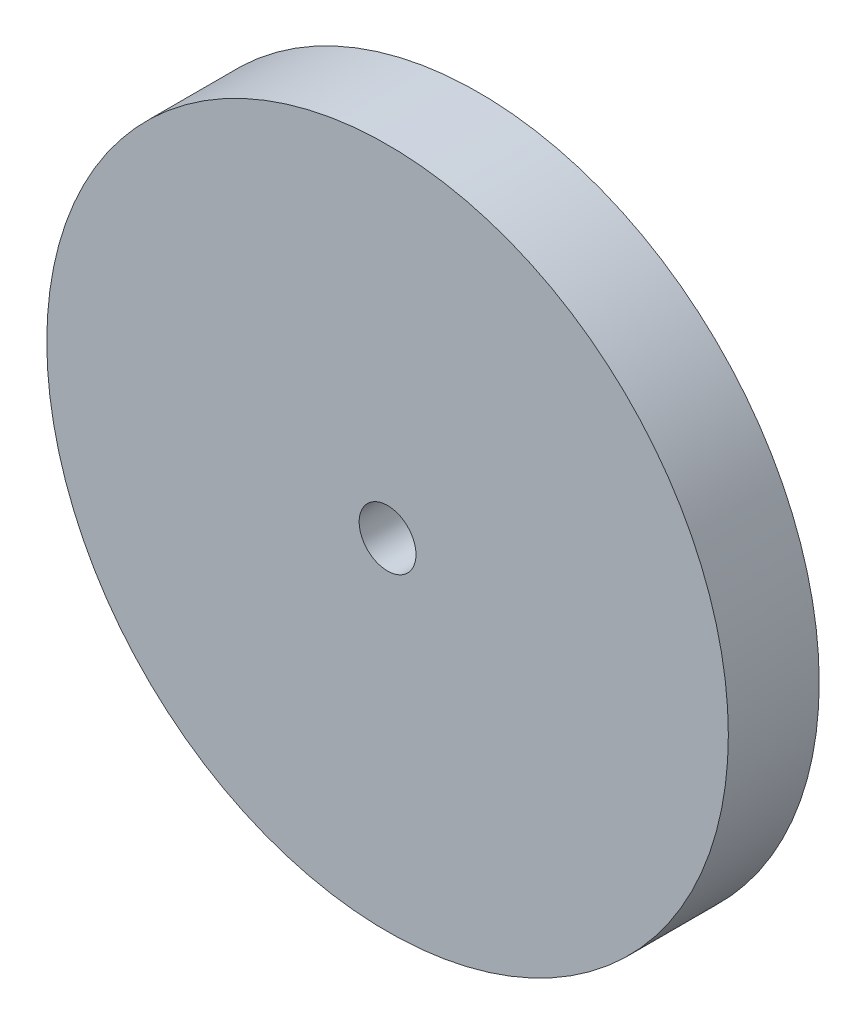
ISO-10303-21;
HEADER;
FILE_DESCRIPTION(('STEP AP214'),'2;1');
FILE_NAME('part.step','',(''),(''),'','','');
FILE_SCHEMA(('AUTOMOTIVE_DESIGN { 1 0 10303 214 1 1 1 1 }'));
ENDSEC;
DATA;
#1=APPLICATION_CONTEXT('core data for automotive mechanical design processes');
#2=APPLICATION_PROTOCOL_DEFINITION('international standard','automotive_design',2000,#1);
#3=PRODUCT_CONTEXT('',#1,'mechanical');
#4=PRODUCT('Part','Part','',(#3));
#5=PRODUCT_RELATED_PRODUCT_CATEGORY('part','',(#4));
#6=PRODUCT_DEFINITION_FORMATION('','',#4);
#7=PRODUCT_DEFINITION_CONTEXT('part definition',#1,'design');
#8=PRODUCT_DEFINITION('design','',#6,#7);
#9=PRODUCT_DEFINITION_SHAPE('','',#8);
#10=(LENGTH_UNIT() NAMED_UNIT(*) SI_UNIT(.MILLI.,.METRE.));
#11=(NAMED_UNIT(*) PLANE_ANGLE_UNIT() SI_UNIT($,.RADIAN.));
#12=(NAMED_UNIT(*) SI_UNIT($,.STERADIAN.) SOLID_ANGLE_UNIT());
#13=UNCERTAINTY_MEASURE_WITH_UNIT(LENGTH_MEASURE(1.E-05),#10,'distance_accuracy_value','');
#14=(GEOMETRIC_REPRESENTATION_CONTEXT(3) GLOBAL_UNCERTAINTY_ASSIGNED_CONTEXT((#13)) GLOBAL_UNIT_ASSIGNED_CONTEXT((#10,
#11,#12)) REPRESENTATION_CONTEXT('',''));
#15=CARTESIAN_POINT('',(0.,0.,0.));
#16=DIRECTION('',(0.,0.,1.));
#17=DIRECTION('',(1.,0.,0.));
#18=AXIS2_PLACEMENT_3D('',#15,#16,#17);
#19=CARTESIAN_POINT('',(0.,0.,2.));
#20=DIRECTION('',(0.,0.,1.));
#21=DIRECTION('',(1.,0.,0.));
#22=AXIS2_PLACEMENT_3D('',#19,#20,#21);
#23=PLANE('',#22);
#24=CARTESIAN_POINT('',(0.,0.,2.));
#25=DIRECTION('',(0.,0.,1.));
#26=DIRECTION('',(1.,0.,0.));
#27=AXIS2_PLACEMENT_3D('',#24,#25,#26);
#28=CIRCLE('',#27,15.);
#29=CARTESIAN_POINT('',(15.,0.,2.));
#30=VERTEX_POINT('',#29);
#31=EDGE_CURVE('E10',#30,#30,#28,.T.);
#32=ORIENTED_EDGE('',*,*,#31,.T.);
#33=EDGE_LOOP('',(#32));
#34=FACE_BOUND('',#33,.T.);
#35=CARTESIAN_POINT('',(0.,0.,2.));
#36=DIRECTION('',(0.,0.,1.));
#37=DIRECTION('',(1.,0.,0.));
#38=AXIS2_PLACEMENT_3D('',#35,#36,#37);
#39=CIRCLE('',#38,1.25);
#40=CARTESIAN_POINT('',(1.25,0.,2.));
#41=VERTEX_POINT('',#40);
#42=EDGE_CURVE('E42',#41,#41,#39,.T.);
#43=ORIENTED_EDGE('',*,*,#42,.F.);
#44=EDGE_LOOP('',(#43));
#45=FACE_BOUND('',#44,.T.);
#46=ADVANCED_FACE('F31',(#34,#45),#23,.T.);
#47=CARTESIAN_POINT('',(0.,0.,-2.));
#48=DIRECTION('',(0.,0.,1.));
#49=DIRECTION('',(1.,0.,0.));
#50=AXIS2_PLACEMENT_3D('',#47,#48,#49);
#51=PLANE('',#50);
#52=CARTESIAN_POINT('',(0.,0.,-2.));
#53=DIRECTION('',(0.,0.,1.));
#54=DIRECTION('',(1.,0.,0.));
#55=AXIS2_PLACEMENT_3D('',#52,#53,#54);
#56=CIRCLE('',#55,15.);
#57=CARTESIAN_POINT('',(15.,0.,-2.));
#58=VERTEX_POINT('',#57);
#59=EDGE_CURVE('E35',#58,#58,#56,.T.);
#60=ORIENTED_EDGE('',*,*,#59,.F.);
#61=EDGE_LOOP('',(#60));
#62=FACE_BOUND('',#61,.T.);
#63=CARTESIAN_POINT('',(0.,0.,-2.));
#64=DIRECTION('',(0.,0.,1.));
#65=DIRECTION('',(1.,0.,0.));
#66=AXIS2_PLACEMENT_3D('',#63,#64,#65);
#67=CIRCLE('',#66,1.25);
#68=CARTESIAN_POINT('',(1.25,0.,-2.));
#69=VERTEX_POINT('',#68);
#70=EDGE_CURVE('E44',#69,#69,#67,.T.);
#71=ORIENTED_EDGE('',*,*,#70,.T.);
#72=EDGE_LOOP('',(#71));
#73=FACE_BOUND('',#72,.T.);
#74=ADVANCED_FACE('F54',(#62,#73),#51,.F.);
#75=CARTESIAN_POINT('',(0.,0.,2.));
#76=DIRECTION('',(0.,0.,-1.));
#77=DIRECTION('',(-1.,0.,0.));
#78=AXIS2_PLACEMENT_3D('',#75,#76,#77);
#79=CYLINDRICAL_SURFACE('',#78,15.);
#80=ORIENTED_EDGE('',*,*,#31,.F.);
#81=EDGE_LOOP('',(#80));
#82=FACE_BOUND('',#81,.T.);
#83=ORIENTED_EDGE('',*,*,#59,.T.);
#84=EDGE_LOOP('',(#83));
#85=FACE_BOUND('',#84,.T.);
#86=ADVANCED_FACE('F33',(#82,#85),#79,.T.);
#87=CARTESIAN_POINT('',(0.,0.,2.));
#88=DIRECTION('',(0.,0.,-1.));
#89=DIRECTION('',(-1.,0.,0.));
#90=AXIS2_PLACEMENT_3D('',#87,#88,#89);
#91=CYLINDRICAL_SURFACE('',#90,1.25);
#92=ORIENTED_EDGE('',*,*,#42,.T.);
#93=EDGE_LOOP('',(#92));
#94=FACE_BOUND('',#93,.T.);
#95=ORIENTED_EDGE('',*,*,#70,.F.);
#96=EDGE_LOOP('',(#95));
#97=FACE_BOUND('',#96,.T.);
#98=ADVANCED_FACE('F50',(#94,#97),#91,.F.);
#99=CLOSED_SHELL('',(#46,#74,#86,#98));
#100=MANIFOLD_SOLID_BREP('B2',#99);
#101=ADVANCED_BREP_SHAPE_REPRESENTATION('',(#18,#100),#14);
#102=SHAPE_DEFINITION_REPRESENTATION(#9,#101);
ENDSEC;
END-ISO-10303-21;
